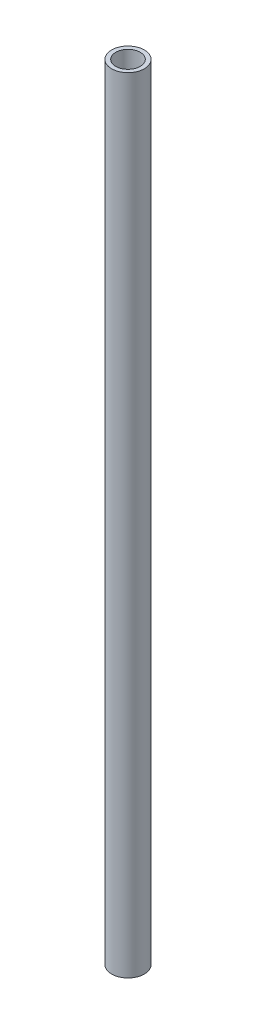
ISO-10303-21;
HEADER;
FILE_DESCRIPTION(('STEP AP214'),'2;1');
FILE_NAME('part.step','',(''),(''),'','','');
FILE_SCHEMA(('AUTOMOTIVE_DESIGN { 1 0 10303 214 1 1 1 1 }'));
ENDSEC;
DATA;
#1=APPLICATION_CONTEXT('core data for automotive mechanical design processes');
#2=APPLICATION_PROTOCOL_DEFINITION('international standard','automotive_design',2000,#1);
#3=PRODUCT_CONTEXT('',#1,'mechanical');
#4=PRODUCT('Part','Part','',(#3));
#5=PRODUCT_RELATED_PRODUCT_CATEGORY('part','',(#4));
#6=PRODUCT_DEFINITION_FORMATION('','',#4);
#7=PRODUCT_DEFINITION_CONTEXT('part definition',#1,'design');
#8=PRODUCT_DEFINITION('design','',#6,#7);
#9=PRODUCT_DEFINITION_SHAPE('','',#8);
#10=(LENGTH_UNIT() NAMED_UNIT(*) SI_UNIT(.MILLI.,.METRE.));
#11=(NAMED_UNIT(*) PLANE_ANGLE_UNIT() SI_UNIT($,.RADIAN.));
#12=(NAMED_UNIT(*) SI_UNIT($,.STERADIAN.) SOLID_ANGLE_UNIT());
#13=UNCERTAINTY_MEASURE_WITH_UNIT(LENGTH_MEASURE(1.E-05),#10,'distance_accuracy_value','');
#14=(GEOMETRIC_REPRESENTATION_CONTEXT(3) GLOBAL_UNCERTAINTY_ASSIGNED_CONTEXT((#13)) GLOBAL_UNIT_ASSIGNED_CONTEXT((#10,
#11,#12)) REPRESENTATION_CONTEXT('',''));
#15=CARTESIAN_POINT('',(0.,0.,0.));
#16=DIRECTION('',(0.,0.,1.));
#17=DIRECTION('',(1.,0.,0.));
#18=AXIS2_PLACEMENT_3D('',#15,#16,#17);
#19=CARTESIAN_POINT('',(0.,609.6,0.));
#20=DIRECTION('',(0.,1.,0.));
#21=DIRECTION('',(0.,0.,1.));
#22=AXIS2_PLACEMENT_3D('',#19,#20,#21);
#23=PLANE('',#22);
#24=CARTESIAN_POINT('',(0.,609.6,0.));
#25=DIRECTION('',(0.,1.,0.));
#26=DIRECTION('',(0.,0.,1.));
#27=AXIS2_PLACEMENT_3D('',#24,#25,#26);
#28=CIRCLE('',#27,12.7);
#29=CARTESIAN_POINT('',(0.,609.6,12.7));
#30=VERTEX_POINT('',#29);
#31=EDGE_CURVE('E10',#30,#30,#28,.T.);
#32=ORIENTED_EDGE('',*,*,#31,.T.);
#33=EDGE_LOOP('',(#32));
#34=FACE_BOUND('',#33,.T.);
#35=CARTESIAN_POINT('',(0.,609.6,0.));
#36=DIRECTION('',(0.,1.,0.));
#37=DIRECTION('',(0.,0.,1.));
#38=AXIS2_PLACEMENT_3D('',#35,#36,#37);
#39=CIRCLE('',#38,9.525);
#40=CARTESIAN_POINT('',(0.,609.6,9.525));
#41=VERTEX_POINT('',#40);
#42=EDGE_CURVE('E41',#41,#41,#39,.T.);
#43=ORIENTED_EDGE('',*,*,#42,.F.);
#44=EDGE_LOOP('',(#43));
#45=FACE_BOUND('',#44,.T.);
#46=ADVANCED_FACE('F30',(#34,#45),#23,.T.);
#47=CARTESIAN_POINT('',(0.,0.,0.));
#48=DIRECTION('',(0.,1.,0.));
#49=DIRECTION('',(0.,0.,1.));
#50=AXIS2_PLACEMENT_3D('',#47,#48,#49);
#51=PLANE('',#50);
#52=CARTESIAN_POINT('',(0.,0.,0.));
#53=DIRECTION('',(0.,1.,0.));
#54=DIRECTION('',(0.,0.,1.));
#55=AXIS2_PLACEMENT_3D('',#52,#53,#54);
#56=CIRCLE('',#55,12.7);
#57=CARTESIAN_POINT('',(0.,0.,12.7));
#58=VERTEX_POINT('',#57);
#59=EDGE_CURVE('E34',#58,#58,#56,.T.);
#60=ORIENTED_EDGE('',*,*,#59,.F.);
#61=EDGE_LOOP('',(#60));
#62=FACE_BOUND('',#61,.T.);
#63=CARTESIAN_POINT('',(0.,0.,0.));
#64=DIRECTION('',(0.,1.,0.));
#65=DIRECTION('',(0.,0.,1.));
#66=AXIS2_PLACEMENT_3D('',#63,#64,#65);
#67=CIRCLE('',#66,9.525);
#68=CARTESIAN_POINT('',(0.,0.,9.525));
#69=VERTEX_POINT('',#68);
#70=EDGE_CURVE('E43',#69,#69,#67,.T.);
#71=ORIENTED_EDGE('',*,*,#70,.T.);
#72=EDGE_LOOP('',(#71));
#73=FACE_BOUND('',#72,.T.);
#74=ADVANCED_FACE('F53',(#62,#73),#51,.F.);
#75=CARTESIAN_POINT('',(0.,609.6,0.));
#76=DIRECTION('',(0.,-1.,0.));
#77=DIRECTION('',(0.,0.,-1.));
#78=AXIS2_PLACEMENT_3D('',#75,#76,#77);
#79=CYLINDRICAL_SURFACE('',#78,12.7);
#80=ORIENTED_EDGE('',*,*,#31,.F.);
#81=EDGE_LOOP('',(#80));
#82=FACE_BOUND('',#81,.T.);
#83=ORIENTED_EDGE('',*,*,#59,.T.);
#84=EDGE_LOOP('',(#83));
#85=FACE_BOUND('',#84,.T.);
#86=ADVANCED_FACE('F32',(#82,#85),#79,.T.);
#87=CARTESIAN_POINT('',(0.,609.6,0.));
#88=DIRECTION('',(0.,-1.,0.));
#89=DIRECTION('',(0.,0.,-1.));
#90=AXIS2_PLACEMENT_3D('',#87,#88,#89);
#91=CYLINDRICAL_SURFACE('',#90,9.525);
#92=ORIENTED_EDGE('',*,*,#42,.T.);
#93=EDGE_LOOP('',(#92));
#94=FACE_BOUND('',#93,.T.);
#95=ORIENTED_EDGE('',*,*,#70,.F.);
#96=EDGE_LOOP('',(#95));
#97=FACE_BOUND('',#96,.T.);
#98=ADVANCED_FACE('F49',(#94,#97),#91,.F.);
#99=CLOSED_SHELL('',(#46,#74,#86,#98));
#100=MANIFOLD_SOLID_BREP('B2',#99);
#101=ADVANCED_BREP_SHAPE_REPRESENTATION('',(#18,#100),#14);
#102=SHAPE_DEFINITION_REPRESENTATION(#9,#101);
ENDSEC;
END-ISO-10303-21;
